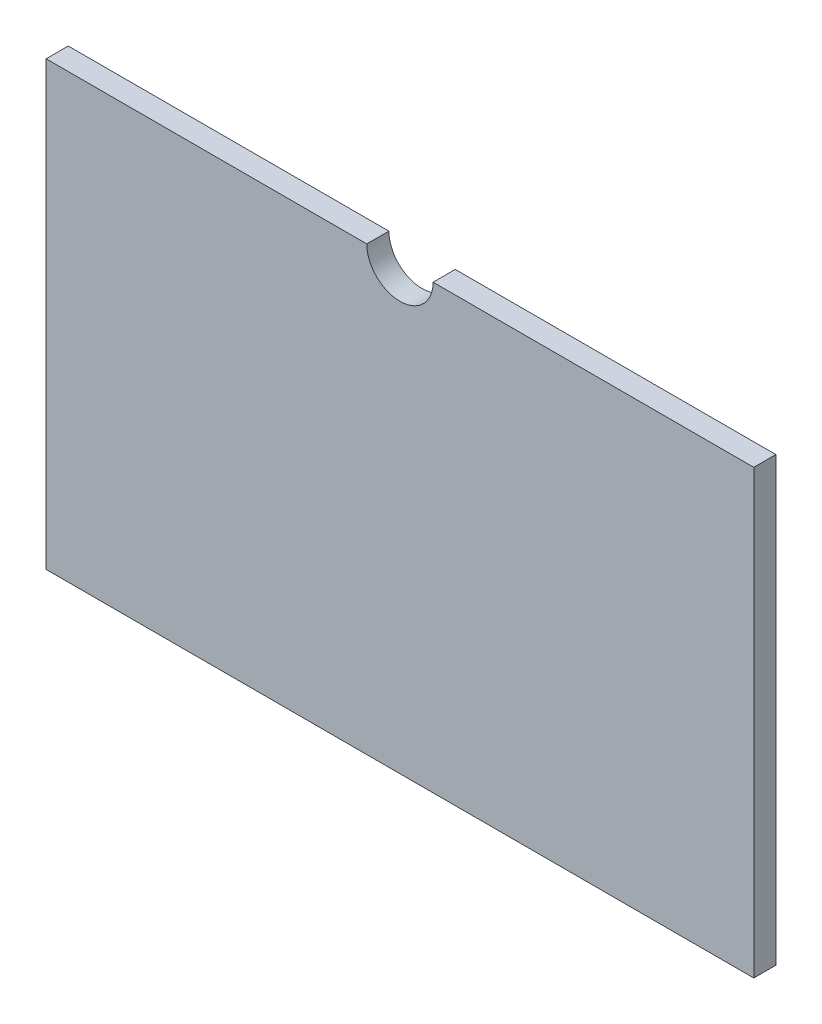
ISO-10303-21;
HEADER;
FILE_DESCRIPTION(('STEP AP214'),'2;1');
FILE_NAME('part.step','',(''),(''),'','','');
FILE_SCHEMA(('AUTOMOTIVE_DESIGN { 1 0 10303 214 1 1 1 1 }'));
ENDSEC;
DATA;
#1=APPLICATION_CONTEXT('core data for automotive mechanical design processes');
#2=APPLICATION_PROTOCOL_DEFINITION('international standard','automotive_design',2000,#1);
#3=PRODUCT_CONTEXT('',#1,'mechanical');
#4=PRODUCT('Part','Part','',(#3));
#5=PRODUCT_RELATED_PRODUCT_CATEGORY('part','',(#4));
#6=PRODUCT_DEFINITION_FORMATION('','',#4);
#7=PRODUCT_DEFINITION_CONTEXT('part definition',#1,'design');
#8=PRODUCT_DEFINITION('design','',#6,#7);
#9=PRODUCT_DEFINITION_SHAPE('','',#8);
#10=(LENGTH_UNIT() NAMED_UNIT(*) SI_UNIT(.MILLI.,.METRE.));
#11=(NAMED_UNIT(*) PLANE_ANGLE_UNIT() SI_UNIT($,.RADIAN.));
#12=(NAMED_UNIT(*) SI_UNIT($,.STERADIAN.) SOLID_ANGLE_UNIT());
#13=UNCERTAINTY_MEASURE_WITH_UNIT(LENGTH_MEASURE(1.E-05),#10,'distance_accuracy_value','');
#14=(GEOMETRIC_REPRESENTATION_CONTEXT(3) GLOBAL_UNCERTAINTY_ASSIGNED_CONTEXT((#13)) GLOBAL_UNIT_ASSIGNED_CONTEXT((#10,
#11,#12)) REPRESENTATION_CONTEXT('',''));
#15=CARTESIAN_POINT('',(0.,0.,0.));
#16=DIRECTION('',(0.,0.,1.));
#17=DIRECTION('',(1.,0.,0.));
#18=AXIS2_PLACEMENT_3D('',#15,#16,#17);
#19=CARTESIAN_POINT('',(-160.,100.,10.));
#20=DIRECTION('',(1.,0.,0.));
#21=DIRECTION('',(0.,0.,-1.));
#22=AXIS2_PLACEMENT_3D('',#19,#20,#21);
#23=PLANE('',#22);
#24=DIRECTION('',(0.,-1.,0.));
#25=VECTOR('',#24,1.);
#26=CARTESIAN_POINT('',(-160.,100.,0.));
#27=LINE('',#26,#25);
#28=CARTESIAN_POINT('',(-160.,100.,0.));
#29=VERTEX_POINT('',#28);
#30=CARTESIAN_POINT('',(-160.,-100.,0.));
#31=VERTEX_POINT('',#30);
#32=EDGE_CURVE('E118',#29,#31,#27,.T.);
#33=ORIENTED_EDGE('',*,*,#32,.T.);
#34=DIRECTION('',(0.,0.,-1.));
#35=VECTOR('',#34,1.);
#36=CARTESIAN_POINT('',(-160.,-100.,10.));
#37=LINE('',#36,#35);
#38=CARTESIAN_POINT('',(-160.,-100.,10.));
#39=VERTEX_POINT('',#38);
#40=EDGE_CURVE('E11',#39,#31,#37,.T.);
#41=ORIENTED_EDGE('',*,*,#40,.F.);
#42=DIRECTION('',(0.,-1.,0.));
#43=VECTOR('',#42,1.);
#44=CARTESIAN_POINT('',(-160.,100.,10.));
#45=LINE('',#44,#43);
#46=CARTESIAN_POINT('',(-160.,100.,10.));
#47=VERTEX_POINT('',#46);
#48=EDGE_CURVE('E128',#47,#39,#45,.T.);
#49=ORIENTED_EDGE('',*,*,#48,.F.);
#50=DIRECTION('',(0.,0.,-1.));
#51=VECTOR('',#50,1.);
#52=CARTESIAN_POINT('',(-160.,100.,10.));
#53=LINE('',#52,#51);
#54=EDGE_CURVE('E114',#47,#29,#53,.T.);
#55=ORIENTED_EDGE('',*,*,#54,.T.);
#56=EDGE_LOOP('',(#33,#41,#49,#55));
#57=FACE_BOUND('',#56,.T.);
#58=ADVANCED_FACE('F34',(#57),#23,.F.);
#59=CARTESIAN_POINT('',(-160.,-100.,10.));
#60=DIRECTION('',(0.,1.,0.));
#61=DIRECTION('',(-1.,0.,0.));
#62=AXIS2_PLACEMENT_3D('',#59,#60,#61);
#63=PLANE('',#62);
#64=DIRECTION('',(1.,0.,0.));
#65=VECTOR('',#64,1.);
#66=CARTESIAN_POINT('',(-160.,-100.,0.));
#67=LINE('',#66,#65);
#68=CARTESIAN_POINT('',(160.,-100.,0.));
#69=VERTEX_POINT('',#68);
#70=EDGE_CURVE('E121',#31,#69,#67,.T.);
#71=ORIENTED_EDGE('',*,*,#70,.T.);
#72=DIRECTION('',(0.,0.,-1.));
#73=VECTOR('',#72,1.);
#74=CARTESIAN_POINT('',(160.,-100.,10.));
#75=LINE('',#74,#73);
#76=CARTESIAN_POINT('',(160.,-100.,10.));
#77=VERTEX_POINT('',#76);
#78=EDGE_CURVE('E42',#77,#69,#75,.T.);
#79=ORIENTED_EDGE('',*,*,#78,.F.);
#80=DIRECTION('',(1.,0.,0.));
#81=VECTOR('',#80,1.);
#82=CARTESIAN_POINT('',(-160.,-100.,10.));
#83=LINE('',#82,#81);
#84=EDGE_CURVE('E87',#39,#77,#83,.T.);
#85=ORIENTED_EDGE('',*,*,#84,.F.);
#86=ORIENTED_EDGE('',*,*,#40,.T.);
#87=EDGE_LOOP('',(#71,#79,#85,#86));
#88=FACE_BOUND('',#87,.T.);
#89=ADVANCED_FACE('F152',(#88),#63,.F.);
#90=CARTESIAN_POINT('',(160.,100.,10.));
#91=DIRECTION('',(-1.,0.,0.));
#92=DIRECTION('',(0.,0.,1.));
#93=AXIS2_PLACEMENT_3D('',#90,#91,#92);
#94=PLANE('',#93);
#95=DIRECTION('',(0.,1.,0.));
#96=VECTOR('',#95,1.);
#97=CARTESIAN_POINT('',(160.,100.,0.));
#98=LINE('',#97,#96);
#99=CARTESIAN_POINT('',(160.,100.,0.));
#100=VERTEX_POINT('',#99);
#101=EDGE_CURVE('E123',#69,#100,#98,.T.);
#102=ORIENTED_EDGE('',*,*,#101,.T.);
#103=DIRECTION('',(0.,0.,-1.));
#104=VECTOR('',#103,1.);
#105=CARTESIAN_POINT('',(160.,100.,10.));
#106=LINE('',#105,#104);
#107=CARTESIAN_POINT('',(160.,100.,10.));
#108=VERTEX_POINT('',#107);
#109=EDGE_CURVE('E109',#108,#100,#106,.T.);
#110=ORIENTED_EDGE('',*,*,#109,.F.);
#111=DIRECTION('',(0.,1.,0.));
#112=VECTOR('',#111,1.);
#113=CARTESIAN_POINT('',(160.,100.,10.));
#114=LINE('',#113,#112);
#115=EDGE_CURVE('E100',#77,#108,#114,.T.);
#116=ORIENTED_EDGE('',*,*,#115,.F.);
#117=ORIENTED_EDGE('',*,*,#78,.T.);
#118=EDGE_LOOP('',(#102,#110,#116,#117));
#119=FACE_BOUND('',#118,.T.);
#120=ADVANCED_FACE('F134',(#119),#94,.F.);
#121=CARTESIAN_POINT('',(15.,100.,10.));
#122=DIRECTION('',(0.,-1.,0.));
#123=DIRECTION('',(1.,0.,0.));
#124=AXIS2_PLACEMENT_3D('',#121,#122,#123);
#125=PLANE('',#124);
#126=DIRECTION('',(-1.,0.,0.));
#127=VECTOR('',#126,1.);
#128=CARTESIAN_POINT('',(15.,100.,0.));
#129=LINE('',#128,#127);
#130=CARTESIAN_POINT('',(15.,100.,0.));
#131=VERTEX_POINT('',#130);
#132=EDGE_CURVE('E108',#100,#131,#129,.T.);
#133=ORIENTED_EDGE('',*,*,#132,.T.);
#134=DIRECTION('',(0.,0.,-1.));
#135=VECTOR('',#134,1.);
#136=CARTESIAN_POINT('',(15.,100.,10.));
#137=LINE('',#136,#135);
#138=CARTESIAN_POINT('',(15.,100.,10.));
#139=VERTEX_POINT('',#138);
#140=EDGE_CURVE('E105',#139,#131,#137,.T.);
#141=ORIENTED_EDGE('',*,*,#140,.F.);
#142=DIRECTION('',(-1.,0.,0.));
#143=VECTOR('',#142,1.);
#144=CARTESIAN_POINT('',(15.,100.,10.));
#145=LINE('',#144,#143);
#146=EDGE_CURVE('E94',#108,#139,#145,.T.);
#147=ORIENTED_EDGE('',*,*,#146,.F.);
#148=ORIENTED_EDGE('',*,*,#109,.T.);
#149=EDGE_LOOP('',(#133,#141,#147,#148));
#150=FACE_BOUND('',#149,.T.);
#151=ADVANCED_FACE('F106',(#150),#125,.F.);
#152=CARTESIAN_POINT('',(0.,100.,10.));
#153=DIRECTION('',(0.,0.,-1.));
#154=DIRECTION('',(-1.,0.,0.));
#155=AXIS2_PLACEMENT_3D('',#152,#153,#154);
#156=CYLINDRICAL_SURFACE('',#155,15.);
#157=CARTESIAN_POINT('',(0.,100.,0.));
#158=DIRECTION('',(0.,0.,-1.));
#159=DIRECTION('',(-1.,0.,0.));
#160=AXIS2_PLACEMENT_3D('',#157,#158,#159);
#161=CIRCLE('',#160,15.);
#162=CARTESIAN_POINT('',(-15.,100.,0.));
#163=VERTEX_POINT('',#162);
#164=EDGE_CURVE('E73',#131,#163,#161,.T.);
#165=ORIENTED_EDGE('',*,*,#164,.T.);
#166=DIRECTION('',(0.,0.,-1.));
#167=VECTOR('',#166,1.);
#168=CARTESIAN_POINT('',(-15.,100.,10.));
#169=LINE('',#168,#167);
#170=CARTESIAN_POINT('',(-15.,100.,10.));
#171=VERTEX_POINT('',#170);
#172=EDGE_CURVE('E110',#171,#163,#169,.T.);
#173=ORIENTED_EDGE('',*,*,#172,.F.);
#174=CARTESIAN_POINT('',(0.,100.,10.));
#175=DIRECTION('',(0.,0.,-1.));
#176=DIRECTION('',(-1.,0.,0.));
#177=AXIS2_PLACEMENT_3D('',#174,#175,#176);
#178=CIRCLE('',#177,15.);
#179=EDGE_CURVE('E98',#139,#171,#178,.T.);
#180=ORIENTED_EDGE('',*,*,#179,.F.);
#181=ORIENTED_EDGE('',*,*,#140,.T.);
#182=EDGE_LOOP('',(#165,#173,#180,#181));
#183=FACE_BOUND('',#182,.T.);
#184=ADVANCED_FACE('F112',(#183),#156,.F.);
#185=CARTESIAN_POINT('',(-160.,100.,10.));
#186=DIRECTION('',(0.,-1.,0.));
#187=DIRECTION('',(0.,0.,-1.));
#188=AXIS2_PLACEMENT_3D('',#185,#186,#187);
#189=PLANE('',#188);
#190=DIRECTION('',(-1.,0.,0.));
#191=VECTOR('',#190,1.);
#192=CARTESIAN_POINT('',(-160.,100.,0.));
#193=LINE('',#192,#191);
#194=EDGE_CURVE('E79',#163,#29,#193,.T.);
#195=ORIENTED_EDGE('',*,*,#194,.T.);
#196=ORIENTED_EDGE('',*,*,#54,.F.);
#197=DIRECTION('',(-1.,0.,0.));
#198=VECTOR('',#197,1.);
#199=CARTESIAN_POINT('',(-160.,100.,10.));
#200=LINE('',#199,#198);
#201=EDGE_CURVE('E50',#171,#47,#200,.T.);
#202=ORIENTED_EDGE('',*,*,#201,.F.);
#203=ORIENTED_EDGE('',*,*,#172,.T.);
#204=EDGE_LOOP('',(#195,#196,#202,#203));
#205=FACE_BOUND('',#204,.T.);
#206=ADVANCED_FACE('F141',(#205),#189,.F.);
#207=CARTESIAN_POINT('',(0.,100.,10.));
#208=DIRECTION('',(0.,0.,-1.));
#209=DIRECTION('',(-1.,0.,0.));
#210=AXIS2_PLACEMENT_3D('',#207,#208,#209);
#211=PLANE('',#210);
#212=ORIENTED_EDGE('',*,*,#48,.T.);
#213=ORIENTED_EDGE('',*,*,#84,.T.);
#214=ORIENTED_EDGE('',*,*,#115,.T.);
#215=ORIENTED_EDGE('',*,*,#146,.T.);
#216=ORIENTED_EDGE('',*,*,#179,.T.);
#217=ORIENTED_EDGE('',*,*,#201,.T.);
#218=EDGE_LOOP('',(#212,#213,#214,#215,#216,#217));
#219=FACE_BOUND('',#218,.T.);
#220=ADVANCED_FACE('F96',(#219),#211,.F.);
#221=CARTESIAN_POINT('',(0.,100.,0.));
#222=DIRECTION('',(0.,0.,-1.));
#223=DIRECTION('',(-1.,0.,0.));
#224=AXIS2_PLACEMENT_3D('',#221,#222,#223);
#225=PLANE('',#224);
#226=ORIENTED_EDGE('',*,*,#32,.F.);
#227=ORIENTED_EDGE('',*,*,#194,.F.);
#228=ORIENTED_EDGE('',*,*,#164,.F.);
#229=ORIENTED_EDGE('',*,*,#132,.F.);
#230=ORIENTED_EDGE('',*,*,#101,.F.);
#231=ORIENTED_EDGE('',*,*,#70,.F.);
#232=EDGE_LOOP('',(#226,#227,#228,#229,#230,#231));
#233=FACE_BOUND('',#232,.T.);
#234=ADVANCED_FACE('F137',(#233),#225,.T.);
#235=CLOSED_SHELL('',(#58,#89,#120,#151,#184,#206,#220,#234));
#236=MANIFOLD_SOLID_BREP('B2',#235);
#237=ADVANCED_BREP_SHAPE_REPRESENTATION('',(#18,#236),#14);
#238=SHAPE_DEFINITION_REPRESENTATION(#9,#237);
ENDSEC;
END-ISO-10303-21;
